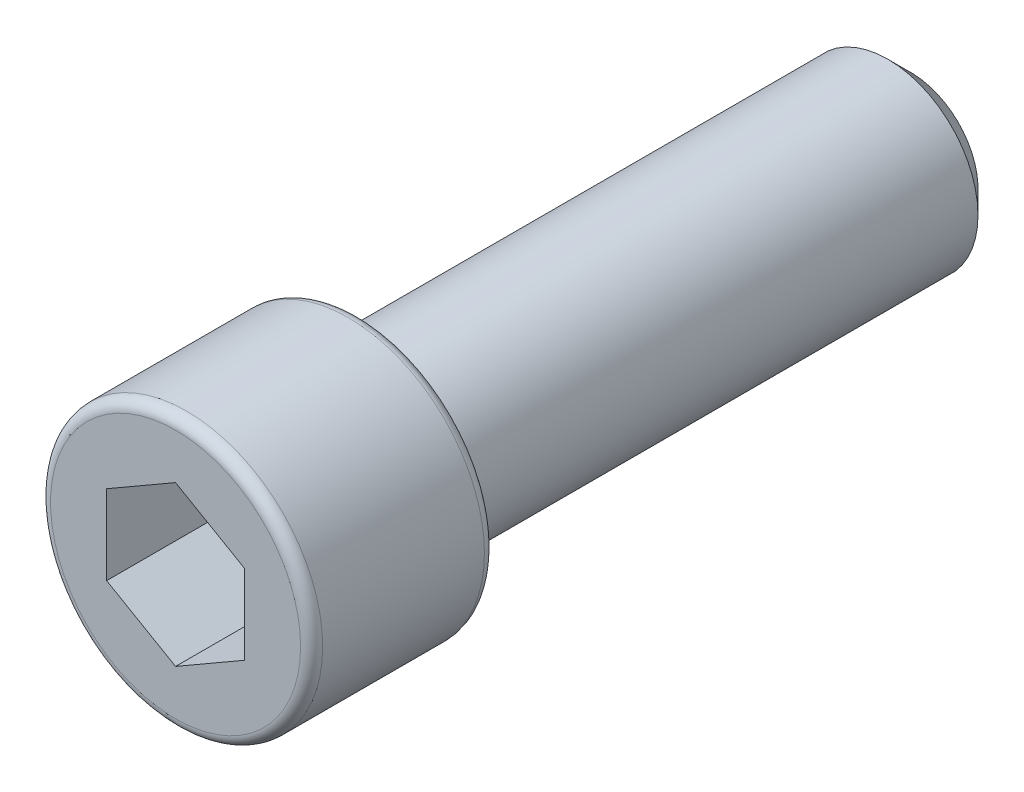
ISO-10303-21;
HEADER;
FILE_DESCRIPTION(('STEP AP214'),'2;1');
FILE_NAME('part.step','',(''),(''),'','','');
FILE_SCHEMA(('AUTOMOTIVE_DESIGN { 1 0 10303 214 1 1 1 1 }'));
ENDSEC;
DATA;
#1=APPLICATION_CONTEXT('core data for automotive mechanical design processes');
#2=APPLICATION_PROTOCOL_DEFINITION('international standard','automotive_design',2000,#1);
#3=PRODUCT_CONTEXT('',#1,'mechanical');
#4=PRODUCT('Part','Part','',(#3));
#5=PRODUCT_RELATED_PRODUCT_CATEGORY('part','',(#4));
#6=PRODUCT_DEFINITION_FORMATION('','',#4);
#7=PRODUCT_DEFINITION_CONTEXT('part definition',#1,'design');
#8=PRODUCT_DEFINITION('design','',#6,#7);
#9=PRODUCT_DEFINITION_SHAPE('','',#8);
#10=(LENGTH_UNIT() NAMED_UNIT(*) SI_UNIT(.MILLI.,.METRE.));
#11=(NAMED_UNIT(*) PLANE_ANGLE_UNIT() SI_UNIT($,.RADIAN.));
#12=(NAMED_UNIT(*) SI_UNIT($,.STERADIAN.) SOLID_ANGLE_UNIT());
#13=UNCERTAINTY_MEASURE_WITH_UNIT(LENGTH_MEASURE(1.E-05),#10,'distance_accuracy_value','');
#14=(GEOMETRIC_REPRESENTATION_CONTEXT(3) GLOBAL_UNCERTAINTY_ASSIGNED_CONTEXT((#13)) GLOBAL_UNIT_ASSIGNED_CONTEXT((#10,
#11,#12)) REPRESENTATION_CONTEXT('',''));
#15=CARTESIAN_POINT('',(0.,0.,0.));
#16=DIRECTION('',(0.,0.,1.));
#17=DIRECTION('',(1.,0.,0.));
#18=AXIS2_PLACEMENT_3D('',#15,#16,#17);
#19=CARTESIAN_POINT('',(4.699,0.,0.));
#20=DIRECTION('',(0.,0.,-1.));
#21=DIRECTION('',(-1.,0.,0.));
#22=AXIS2_PLACEMENT_3D('',#19,#20,#21);
#23=PLANE('',#22);
#24=CARTESIAN_POINT('',(0.,0.,0.));
#25=DIRECTION('',(0.,0.,-1.));
#26=DIRECTION('',(-1.,0.,0.));
#27=AXIS2_PLACEMENT_3D('',#24,#25,#26);
#28=CIRCLE('',#27,4.3179999999999);
#29=CARTESIAN_POINT('',(-4.3179999999999,0.,0.));
#30=VERTEX_POINT('',#29);
#31=EDGE_CURVE('E11',#30,#30,#28,.T.);
#32=ORIENTED_EDGE('',*,*,#31,.T.);
#33=EDGE_LOOP('',(#32));
#34=FACE_BOUND('',#33,.T.);
#35=CARTESIAN_POINT('',(0.,0.,0.));
#36=DIRECTION('',(0.,0.,-1.));
#37=DIRECTION('',(-1.,0.,0.));
#38=AXIS2_PLACEMENT_3D('',#35,#36,#37);
#39=CIRCLE('',#38,3.1115);
#40=CARTESIAN_POINT('',(-3.1115,0.,0.));
#41=VERTEX_POINT('',#40);
#42=EDGE_CURVE('E134',#41,#41,#39,.T.);
#43=ORIENTED_EDGE('',*,*,#42,.F.);
#44=EDGE_LOOP('',(#43));
#45=FACE_BOUND('',#44,.T.);
#46=ADVANCED_FACE('F32',(#34,#45),#23,.T.);
#47=CARTESIAN_POINT('',(0.,0.,0.));
#48=DIRECTION('',(0.,0.,1.));
#49=DIRECTION('',(1.,0.,0.));
#50=AXIS2_PLACEMENT_3D('',#47,#48,#49);
#51=CYLINDRICAL_SURFACE('',#50,4.699);
#52=CARTESIAN_POINT('',(0.,0.,0.381000000000101));
#53=DIRECTION('',(0.,0.,-1.));
#54=DIRECTION('',(-1.,0.,0.));
#55=AXIS2_PLACEMENT_3D('',#52,#53,#54);
#56=CIRCLE('',#55,4.699);
#57=CARTESIAN_POINT('',(-4.699,0.,0.381000000000101));
#58=VERTEX_POINT('',#57);
#59=EDGE_CURVE('E40',#58,#58,#56,.F.);
#60=ORIENTED_EDGE('',*,*,#59,.T.);
#61=EDGE_LOOP('',(#60));
#62=FACE_BOUND('',#61,.T.);
#63=CARTESIAN_POINT('',(0.,0.,5.96900000000002));
#64=DIRECTION('',(0.,0.,1.));
#65=DIRECTION('',(1.,0.,0.));
#66=AXIS2_PLACEMENT_3D('',#63,#64,#65);
#67=CIRCLE('',#66,4.699);
#68=CARTESIAN_POINT('',(4.699,0.,5.96900000000002));
#69=VERTEX_POINT('',#68);
#70=EDGE_CURVE('E151',#69,#69,#67,.F.);
#71=ORIENTED_EDGE('',*,*,#70,.T.);
#72=EDGE_LOOP('',(#71));
#73=FACE_BOUND('',#72,.T.);
#74=ADVANCED_FACE('F156',(#62,#73),#51,.T.);
#75=CARTESIAN_POINT('',(0.,0.,6.35));
#76=DIRECTION('',(0.,0.,1.));
#77=DIRECTION('',(1.,0.,0.));
#78=AXIS2_PLACEMENT_3D('',#75,#76,#77);
#79=PLANE('',#78);
#80=CARTESIAN_POINT('',(0.,0.,6.35));
#81=DIRECTION('',(0.,0.,1.));
#82=DIRECTION('',(1.,0.,0.));
#83=AXIS2_PLACEMENT_3D('',#80,#81,#82);
#84=CIRCLE('',#83,4.31800000000003);
#85=CARTESIAN_POINT('',(4.31800000000002,0.,6.35));
#86=VERTEX_POINT('',#85);
#87=EDGE_CURVE('E148',#86,#86,#84,.T.);
#88=ORIENTED_EDGE('',*,*,#87,.T.);
#89=EDGE_LOOP('',(#88));
#90=FACE_BOUND('',#89,.T.);
#91=DIRECTION('',(0.,1.,0.));
#92=VECTOR('',#91,1.);
#93=CARTESIAN_POINT('',(2.38125,-1.37481532850776,6.35));
#94=LINE('',#93,#92);
#95=CARTESIAN_POINT('',(2.38125,-1.37481532850776,6.35));
#96=VERTEX_POINT('',#95);
#97=CARTESIAN_POINT('',(2.38125,1.37481532850786,6.35));
#98=VERTEX_POINT('',#97);
#99=EDGE_CURVE('E47',#96,#98,#94,.T.);
#100=ORIENTED_EDGE('',*,*,#99,.F.);
#101=DIRECTION('',(0.866025403784428,0.500000000000018,0.));
#102=VECTOR('',#101,1.);
#103=CARTESIAN_POINT('',(0.,-2.74963065701563,6.35));
#104=LINE('',#103,#102);
#105=CARTESIAN_POINT('',(0.,-2.74963065701563,6.35));
#106=VERTEX_POINT('',#105);
#107=EDGE_CURVE('E130',#106,#96,#104,.T.);
#108=ORIENTED_EDGE('',*,*,#107,.F.);
#109=DIRECTION('',(0.866025403784444,-0.499999999999991,0.));
#110=VECTOR('',#109,1.);
#111=CARTESIAN_POINT('',(-2.38125,-1.37481532850786,6.35));
#112=LINE('',#111,#110);
#113=CARTESIAN_POINT('',(-2.38125,-1.37481532850786,6.35));
#114=VERTEX_POINT('',#113);
#115=EDGE_CURVE('E128',#114,#106,#112,.T.);
#116=ORIENTED_EDGE('',*,*,#115,.F.);
#117=DIRECTION('',(0.,-1.,0.));
#118=VECTOR('',#117,1.);
#119=CARTESIAN_POINT('',(-2.38125,1.37481532850786,6.35));
#120=LINE('',#119,#118);
#121=CARTESIAN_POINT('',(-2.38125,1.37481532850786,6.35));
#122=VERTEX_POINT('',#121);
#123=EDGE_CURVE('E95',#122,#114,#120,.T.);
#124=ORIENTED_EDGE('',*,*,#123,.F.);
#125=DIRECTION('',(-0.866025403784428,-0.500000000000018,0.));
#126=VECTOR('',#125,1.);
#127=CARTESIAN_POINT('',(0.,2.74963065701572,6.35));
#128=LINE('',#127,#126);
#129=CARTESIAN_POINT('',(0.,2.74963065701572,6.35));
#130=VERTEX_POINT('',#129);
#131=EDGE_CURVE('E124',#130,#122,#128,.T.);
#132=ORIENTED_EDGE('',*,*,#131,.F.);
#133=DIRECTION('',(-0.866025403784428,0.500000000000017,0.));
#134=VECTOR('',#133,1.);
#135=CARTESIAN_POINT('',(2.38125,1.37481532850786,6.35));
#136=LINE('',#135,#134);
#137=EDGE_CURVE('E121',#98,#130,#136,.T.);
#138=ORIENTED_EDGE('',*,*,#137,.F.);
#139=EDGE_LOOP('',(#100,#108,#116,#124,#132,#138));
#140=FACE_BOUND('',#139,.T.);
#141=ADVANCED_FACE('F174',(#90,#140),#79,.T.);
#142=CARTESIAN_POINT('',(0.,0.,-19.05));
#143=DIRECTION('',(0.,0.,1.));
#144=DIRECTION('',(1.,0.,0.));
#145=AXIS2_PLACEMENT_3D('',#142,#143,#144);
#146=CYLINDRICAL_SURFACE('',#145,3.1115);
#147=CARTESIAN_POINT('',(0.,0.,-18.2562499992235));
#148=DIRECTION('',(0.,0.,-1.));
#149=DIRECTION('',(-1.,0.,0.));
#150=AXIS2_PLACEMENT_3D('',#147,#148,#149);
#151=CIRCLE('',#150,3.1115);
#152=CARTESIAN_POINT('',(-3.1115,0.,-18.2562499992235));
#153=VERTEX_POINT('',#152);
#154=EDGE_CURVE('E145',#153,#153,#151,.F.);
#155=ORIENTED_EDGE('',*,*,#154,.T.);
#156=EDGE_LOOP('',(#155));
#157=FACE_BOUND('',#156,.T.);
#158=ORIENTED_EDGE('',*,*,#42,.T.);
#159=EDGE_LOOP('',(#158));
#160=FACE_BOUND('',#159,.T.);
#161=ADVANCED_FACE('F194',(#157,#160),#146,.T.);
#162=CARTESIAN_POINT('',(0.,0.,-19.05));
#163=DIRECTION('',(0.,0.,-1.));
#164=DIRECTION('',(-1.,0.,0.));
#165=AXIS2_PLACEMENT_3D('',#162,#163,#164);
#166=PLANE('',#165);
#167=CARTESIAN_POINT('',(0.,0.,-19.05));
#168=DIRECTION('',(0.,0.,-1.));
#169=DIRECTION('',(-1.,0.,0.));
#170=AXIS2_PLACEMENT_3D('',#167,#168,#169);
#171=CIRCLE('',#170,2.31775000064457);
#172=CARTESIAN_POINT('',(-2.31775000064457,0.,-19.05));
#173=VERTEX_POINT('',#172);
#174=EDGE_CURVE('E142',#173,#173,#171,.T.);
#175=ORIENTED_EDGE('',*,*,#174,.T.);
#176=EDGE_LOOP('',(#175));
#177=FACE_BOUND('',#176,.T.);
#178=ADVANCED_FACE('F191',(#177),#166,.T.);
#179=CARTESIAN_POINT('',(2.38125,-1.37481532850776,2.54));
#180=DIRECTION('',(1.,0.,0.));
#181=DIRECTION('',(0.,0.,-1.));
#182=AXIS2_PLACEMENT_3D('',#179,#180,#181);
#183=PLANE('',#182);
#184=ORIENTED_EDGE('',*,*,#99,.T.);
#185=DIRECTION('',(0.,0.,1.));
#186=VECTOR('',#185,1.);
#187=CARTESIAN_POINT('',(2.38125,1.37481532850786,2.54));
#188=LINE('',#187,#186);
#189=CARTESIAN_POINT('',(2.38125,1.37481532850786,2.54));
#190=VERTEX_POINT('',#189);
#191=EDGE_CURVE('E77',#190,#98,#188,.T.);
#192=ORIENTED_EDGE('',*,*,#191,.F.);
#193=DIRECTION('',(0.,1.,0.));
#194=VECTOR('',#193,1.);
#195=CARTESIAN_POINT('',(2.38125,-1.37481532850776,2.54));
#196=LINE('',#195,#194);
#197=CARTESIAN_POINT('',(2.38125,-1.37481532850776,2.54));
#198=VERTEX_POINT('',#197);
#199=EDGE_CURVE('E132',#198,#190,#196,.T.);
#200=ORIENTED_EDGE('',*,*,#199,.F.);
#201=DIRECTION('',(0.,0.,1.));
#202=VECTOR('',#201,1.);
#203=CARTESIAN_POINT('',(2.38125,-1.37481532850776,2.54));
#204=LINE('',#203,#202);
#205=EDGE_CURVE('E55',#198,#96,#204,.T.);
#206=ORIENTED_EDGE('',*,*,#205,.T.);
#207=EDGE_LOOP('',(#184,#192,#200,#206));
#208=FACE_BOUND('',#207,.T.);
#209=ADVANCED_FACE('F193',(#208),#183,.F.);
#210=CARTESIAN_POINT('',(0.,-2.74963065701563,2.54));
#211=DIRECTION('',(0.500000000000018,-0.866025403784428,0.));
#212=DIRECTION('',(0.866025403784428,0.500000000000018,0.));
#213=AXIS2_PLACEMENT_3D('',#210,#211,#212);
#214=PLANE('',#213);
#215=ORIENTED_EDGE('',*,*,#107,.T.);
#216=ORIENTED_EDGE('',*,*,#205,.F.);
#217=DIRECTION('',(0.866025403784428,0.500000000000018,0.));
#218=VECTOR('',#217,1.);
#219=CARTESIAN_POINT('',(0.,-2.74963065701563,2.54));
#220=LINE('',#219,#218);
#221=CARTESIAN_POINT('',(0.,-2.74963065701563,2.54));
#222=VERTEX_POINT('',#221);
#223=EDGE_CURVE('E107',#222,#198,#220,.T.);
#224=ORIENTED_EDGE('',*,*,#223,.F.);
#225=DIRECTION('',(0.,0.,1.));
#226=VECTOR('',#225,1.);
#227=CARTESIAN_POINT('',(0.,-2.74963065701563,2.54));
#228=LINE('',#227,#226);
#229=EDGE_CURVE('E99',#222,#106,#228,.T.);
#230=ORIENTED_EDGE('',*,*,#229,.T.);
#231=EDGE_LOOP('',(#215,#216,#224,#230));
#232=FACE_BOUND('',#231,.T.);
#233=ADVANCED_FACE('F200',(#232),#214,.F.);
#234=CARTESIAN_POINT('',(-2.38125,-1.37481532850786,2.54));
#235=DIRECTION('',(-0.499999999999991,-0.866025403784444,0.));
#236=DIRECTION('',(0.866025403784444,-0.499999999999991,0.));
#237=AXIS2_PLACEMENT_3D('',#234,#235,#236);
#238=PLANE('',#237);
#239=ORIENTED_EDGE('',*,*,#115,.T.);
#240=ORIENTED_EDGE('',*,*,#229,.F.);
#241=DIRECTION('',(0.866025403784444,-0.499999999999991,0.));
#242=VECTOR('',#241,1.);
#243=CARTESIAN_POINT('',(-2.38125,-1.37481532850786,2.54));
#244=LINE('',#243,#242);
#245=CARTESIAN_POINT('',(-2.38125,-1.37481532850786,2.54));
#246=VERTEX_POINT('',#245);
#247=EDGE_CURVE('E103',#246,#222,#244,.T.);
#248=ORIENTED_EDGE('',*,*,#247,.F.);
#249=DIRECTION('',(0.,0.,1.));
#250=VECTOR('',#249,1.);
#251=CARTESIAN_POINT('',(-2.38125,-1.37481532850786,2.54));
#252=LINE('',#251,#250);
#253=EDGE_CURVE('E88',#246,#114,#252,.T.);
#254=ORIENTED_EDGE('',*,*,#253,.T.);
#255=EDGE_LOOP('',(#239,#240,#248,#254));
#256=FACE_BOUND('',#255,.T.);
#257=ADVANCED_FACE('F104',(#256),#238,.F.);
#258=CARTESIAN_POINT('',(-2.38125,1.37481532850786,2.54));
#259=DIRECTION('',(-1.,0.,0.));
#260=DIRECTION('',(0.,-1.,0.));
#261=AXIS2_PLACEMENT_3D('',#258,#259,#260);
#262=PLANE('',#261);
#263=ORIENTED_EDGE('',*,*,#123,.T.);
#264=ORIENTED_EDGE('',*,*,#253,.F.);
#265=DIRECTION('',(0.,-1.,0.));
#266=VECTOR('',#265,1.);
#267=CARTESIAN_POINT('',(-2.38125,1.37481532850786,2.54));
#268=LINE('',#267,#266);
#269=CARTESIAN_POINT('',(-2.38125,1.37481532850786,2.54));
#270=VERTEX_POINT('',#269);
#271=EDGE_CURVE('E92',#270,#246,#268,.T.);
#272=ORIENTED_EDGE('',*,*,#271,.F.);
#273=DIRECTION('',(0.,0.,1.));
#274=VECTOR('',#273,1.);
#275=CARTESIAN_POINT('',(-2.38125,1.37481532850786,2.54));
#276=LINE('',#275,#274);
#277=EDGE_CURVE('E100',#270,#122,#276,.T.);
#278=ORIENTED_EDGE('',*,*,#277,.T.);
#279=EDGE_LOOP('',(#263,#264,#272,#278));
#280=FACE_BOUND('',#279,.T.);
#281=ADVANCED_FACE('F90',(#280),#262,.F.);
#282=CARTESIAN_POINT('',(0.,2.74963065701572,2.54));
#283=DIRECTION('',(-0.500000000000018,0.866025403784428,0.));
#284=DIRECTION('',(-0.866025403784428,-0.500000000000018,0.));
#285=AXIS2_PLACEMENT_3D('',#282,#283,#284);
#286=PLANE('',#285);
#287=ORIENTED_EDGE('',*,*,#131,.T.);
#288=ORIENTED_EDGE('',*,*,#277,.F.);
#289=DIRECTION('',(-0.866025403784428,-0.500000000000018,0.));
#290=VECTOR('',#289,1.);
#291=CARTESIAN_POINT('',(0.,2.74963065701572,2.54));
#292=LINE('',#291,#290);
#293=CARTESIAN_POINT('',(0.,2.74963065701572,2.54));
#294=VERTEX_POINT('',#293);
#295=EDGE_CURVE('E113',#294,#270,#292,.T.);
#296=ORIENTED_EDGE('',*,*,#295,.F.);
#297=DIRECTION('',(0.,0.,1.));
#298=VECTOR('',#297,1.);
#299=CARTESIAN_POINT('',(0.,2.74963065701572,2.54));
#300=LINE('',#299,#298);
#301=EDGE_CURVE('E137',#294,#130,#300,.T.);
#302=ORIENTED_EDGE('',*,*,#301,.T.);
#303=EDGE_LOOP('',(#287,#288,#296,#302));
#304=FACE_BOUND('',#303,.T.);
#305=ADVANCED_FACE('F206',(#304),#286,.F.);
#306=CARTESIAN_POINT('',(2.38125,1.37481532850786,2.54));
#307=DIRECTION('',(0.500000000000017,0.866025403784429,0.));
#308=DIRECTION('',(-0.866025403784429,0.500000000000017,0.));
#309=AXIS2_PLACEMENT_3D('',#306,#307,#308);
#310=PLANE('',#309);
#311=ORIENTED_EDGE('',*,*,#137,.T.);
#312=ORIENTED_EDGE('',*,*,#301,.F.);
#313=DIRECTION('',(-0.866025403784428,0.500000000000017,0.));
#314=VECTOR('',#313,1.);
#315=CARTESIAN_POINT('',(2.38125,1.37481532850786,2.54));
#316=LINE('',#315,#314);
#317=EDGE_CURVE('E115',#190,#294,#316,.T.);
#318=ORIENTED_EDGE('',*,*,#317,.F.);
#319=ORIENTED_EDGE('',*,*,#191,.T.);
#320=EDGE_LOOP('',(#311,#312,#318,#319));
#321=FACE_BOUND('',#320,.T.);
#322=ADVANCED_FACE('F185',(#321),#310,.F.);
#323=CARTESIAN_POINT('',(2.38125,1.37481532850786,2.54));
#324=DIRECTION('',(0.,0.,1.));
#325=DIRECTION('',(1.,0.,0.));
#326=AXIS2_PLACEMENT_3D('',#323,#324,#325);
#327=PLANE('',#326);
#328=ORIENTED_EDGE('',*,*,#199,.T.);
#329=ORIENTED_EDGE('',*,*,#317,.T.);
#330=ORIENTED_EDGE('',*,*,#295,.T.);
#331=ORIENTED_EDGE('',*,*,#271,.T.);
#332=ORIENTED_EDGE('',*,*,#247,.T.);
#333=ORIENTED_EDGE('',*,*,#223,.T.);
#334=EDGE_LOOP('',(#328,#329,#330,#331,#332,#333));
#335=FACE_BOUND('',#334,.T.);
#336=ADVANCED_FACE('F110',(#335),#327,.T.);
#337=CARTESIAN_POINT('',(0.,0.,-19.05));
#338=DIRECTION('',(0.,0.,1.));
#339=DIRECTION('',(1.,0.,0.));
#340=AXIS2_PLACEMENT_3D('',#337,#338,#339);
#341=CONICAL_SURFACE('',#340,2.31775000064457,0.785398162502281);
#342=ORIENTED_EDGE('',*,*,#154,.F.);
#343=EDGE_LOOP('',(#342));
#344=FACE_BOUND('',#343,.T.);
#345=ORIENTED_EDGE('',*,*,#174,.F.);
#346=EDGE_LOOP('',(#345));
#347=FACE_BOUND('',#346,.T.);
#348=ADVANCED_FACE('F165',(#344,#347),#341,.T.);
#349=CARTESIAN_POINT('',(0.,0.,5.96900000000002));
#350=DIRECTION('',(0.,0.,1.));
#351=DIRECTION('',(1.,0.,0.));
#352=AXIS2_PLACEMENT_3D('',#349,#350,#351);
#353=TOROIDAL_SURFACE('',#352,4.31800000000003,0.380999999999975);
#354=ORIENTED_EDGE('',*,*,#70,.F.);
#355=EDGE_LOOP('',(#354));
#356=FACE_BOUND('',#355,.T.);
#357=ORIENTED_EDGE('',*,*,#87,.F.);
#358=EDGE_LOOP('',(#357));
#359=FACE_BOUND('',#358,.T.);
#360=ADVANCED_FACE('F160',(#356,#359),#353,.T.);
#361=CARTESIAN_POINT('',(0.,0.,0.381000000000101));
#362=DIRECTION('',(0.,0.,-1.));
#363=DIRECTION('',(-1.,0.,0.));
#364=AXIS2_PLACEMENT_3D('',#361,#362,#363);
#365=TOROIDAL_SURFACE('',#364,4.3179999999999,0.381000000000101);
#366=ORIENTED_EDGE('',*,*,#31,.F.);
#367=EDGE_LOOP('',(#366));
#368=FACE_BOUND('',#367,.T.);
#369=ORIENTED_EDGE('',*,*,#59,.F.);
#370=EDGE_LOOP('',(#369));
#371=FACE_BOUND('',#370,.T.);
#372=ADVANCED_FACE('F34',(#368,#371),#365,.T.);
#373=CLOSED_SHELL('',(#46,#74,#141,#161,#178,#209,#233,#257,#281,#305,#322,#336,#348,#360,#372));
#374=MANIFOLD_SOLID_BREP('B2',#373);
#375=ADVANCED_BREP_SHAPE_REPRESENTATION('',(#18,#374),#14);
#376=SHAPE_DEFINITION_REPRESENTATION(#9,#375);
ENDSEC;
END-ISO-10303-21;
